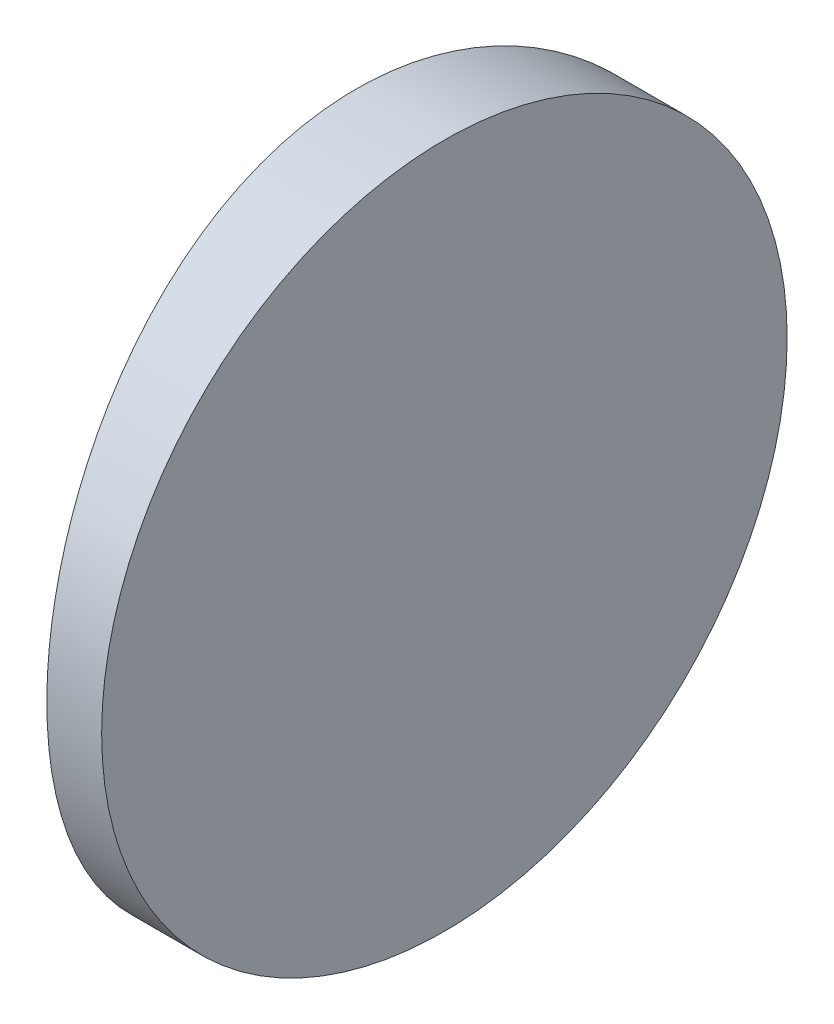
ISO-10303-21;
HEADER;
FILE_DESCRIPTION(('STEP AP214'),'2;1');
FILE_NAME('part.step','',(''),(''),'','','');
FILE_SCHEMA(('AUTOMOTIVE_DESIGN { 1 0 10303 214 1 1 1 1 }'));
ENDSEC;
DATA;
#1=APPLICATION_CONTEXT('core data for automotive mechanical design processes');
#2=APPLICATION_PROTOCOL_DEFINITION('international standard','automotive_design',2000,#1);
#3=PRODUCT_CONTEXT('',#1,'mechanical');
#4=PRODUCT('Part','Part','',(#3));
#5=PRODUCT_RELATED_PRODUCT_CATEGORY('part','',(#4));
#6=PRODUCT_DEFINITION_FORMATION('','',#4);
#7=PRODUCT_DEFINITION_CONTEXT('part definition',#1,'design');
#8=PRODUCT_DEFINITION('design','',#6,#7);
#9=PRODUCT_DEFINITION_SHAPE('','',#8);
#10=(LENGTH_UNIT() NAMED_UNIT(*) SI_UNIT(.MILLI.,.METRE.));
#11=(NAMED_UNIT(*) PLANE_ANGLE_UNIT() SI_UNIT($,.RADIAN.));
#12=(NAMED_UNIT(*) SI_UNIT($,.STERADIAN.) SOLID_ANGLE_UNIT());
#13=UNCERTAINTY_MEASURE_WITH_UNIT(LENGTH_MEASURE(1.E-05),#10,'distance_accuracy_value','');
#14=(GEOMETRIC_REPRESENTATION_CONTEXT(3) GLOBAL_UNCERTAINTY_ASSIGNED_CONTEXT((#13)) GLOBAL_UNIT_ASSIGNED_CONTEXT((#10,
#11,#12)) REPRESENTATION_CONTEXT('',''));
#15=CARTESIAN_POINT('',(0.,0.,0.));
#16=DIRECTION('',(0.,0.,1.));
#17=DIRECTION('',(1.,0.,0.));
#18=AXIS2_PLACEMENT_3D('',#15,#16,#17);
#19=CARTESIAN_POINT('',(4.35520433485127,25.,0.));
#20=DIRECTION('',(0.,-1.,0.));
#21=DIRECTION('',(0.,0.,-1.));
#22=AXIS2_PLACEMENT_3D('',#19,#20,#21);
#23=CYLINDRICAL_SURFACE('',#22,64.6);
#24=CARTESIAN_POINT('',(-60.2447956651487,0.,0.));
#25=CARTESIAN_POINT('',(-60.2447978642015,-4.47395701819799E-06,-0.34765061204116));
#26=CARTESIAN_POINT('',(-60.2419838845254,0.0145088133136891,-0.695238878843603));
#27=CARTESIAN_POINT('',(-60.2308108472901,0.0724415721339745,-1.3880179192886));
#28=CARTESIAN_POINT('',(-60.2224505623605,0.11586744190507,-1.73320814516723));
#29=CARTESIAN_POINT('',(-60.2004052203235,0.231343913212658,-2.4189012180177));
#30=CARTESIAN_POINT('',(-60.1867154092606,0.303420072116305,-2.75939959829363));
#31=CARTESIAN_POINT('',(-60.1543937983129,0.475633075482622,-3.43299360409676));
#32=CARTESIAN_POINT('',(-60.13576186904,0.575770654617422,-3.76608903556191));
#33=CARTESIAN_POINT('',(-60.094094745227,0.803221502005653,-4.42219458082528));
#34=CARTESIAN_POINT('',(-60.0710641031345,0.930506689599237,-4.74521472344349));
#35=CARTESIAN_POINT('',(-60.0212209925623,1.21136737622966,-5.37931384719283));
#36=CARTESIAN_POINT('',(-59.9944084768082,1.36494320391121,-5.69039267899273));
#37=CARTESIAN_POINT('',(-59.937740218217,1.69724548066512,-6.29845358291933));
#38=CARTESIAN_POINT('',(-59.9078849713435,1.87596783266805,-6.5954379409084));
#39=CARTESIAN_POINT('',(-59.845940933979,2.25732267732487,-7.17338318000197));
#40=CARTESIAN_POINT('',(-59.8138521570897,2.45995502437788,-7.45434415866605));
#41=CARTESIAN_POINT('',(-59.7479406019272,2.89016800994314,-8.00147515213488));
#42=CARTESIAN_POINT('',(-59.7141022968138,3.1180052969769,-8.26744152275114));
#43=CARTESIAN_POINT('',(-59.6459719461591,3.59515261684848,-8.7793002924865));
#44=CARTESIAN_POINT('',(-59.6116798955007,3.84446289202493,-9.02519246499234));
#45=CARTESIAN_POINT('',(-59.5435880606616,4.36294174682594,-9.49530269703114));
#46=CARTESIAN_POINT('',(-59.5097884236597,4.63211612355901,-9.71951438490803));
#47=CARTESIAN_POINT('',(-59.4436408586705,5.18843986021949,-10.1446362226158));
#48=CARTESIAN_POINT('',(-59.4112929147794,5.47558902314327,-10.34554662776));
#49=CARTESIAN_POINT('',(-59.348686304986,6.06856484464821,-10.7243421840682));
#50=CARTESIAN_POINT('',(-59.3184488712709,6.37453537096646,-10.902005744523));
#51=CARTESIAN_POINT('',(-59.2612668113804,7.00067398099642,-11.2308712123767));
#52=CARTESIAN_POINT('',(-59.2343221638536,7.32084197262934,-11.3820732913624));
#53=CARTESIAN_POINT('',(-59.1845468915196,7.97280675108691,-11.6567362496679));
#54=CARTESIAN_POINT('',(-59.1617121786897,8.3045915860934,-11.7802247253702));
#55=CARTESIAN_POINT('',(-59.1208107103263,8.97759357839283,-11.9986594820489));
#56=CARTESIAN_POINT('',(-59.1027427871912,9.31880840319166,-12.0936127533776));
#57=CARTESIAN_POINT('',(-59.0665838199291,10.1277030843062,-12.2820655606775));
#58=CARTESIAN_POINT('',(-59.0506471724395,10.5982964410256,-12.3636980310325));
#59=CARTESIAN_POINT('',(-59.0293035642208,11.545965756378,-12.4726616378771));
#60=CARTESIAN_POINT('',(-59.0238963963328,12.0230415872876,-12.4999938426803));
#61=CARTESIAN_POINT('',(-59.0238908115981,12.8475821454311,-12.50000448713));
#62=CARTESIAN_POINT('',(-59.0267583404281,13.1951019332754,-12.4854968592692));
#63=CARTESIAN_POINT('',(-59.038139100787,13.8877421479409,-12.4275872636856));
#64=CARTESIAN_POINT('',(-59.0466535836075,14.2328620258423,-12.3841788919247));
#65=CARTESIAN_POINT('',(-59.0690907355566,14.9184127329047,-12.2687503054409));
#66=CARTESIAN_POINT('',(-59.0830182514507,15.2588390758679,-12.1967044477355));
#67=CARTESIAN_POINT('',(-59.1158715902605,15.932287528186,-12.0245661913625));
#68=CARTESIAN_POINT('',(-59.1347975475306,16.2653094382542,-11.9244730388));
#69=CARTESIAN_POINT('',(-59.177074881072,16.9212585544489,-11.6971294603511));
#70=CARTESIAN_POINT('',(-59.2004215337982,17.2441961106089,-11.5699080031163));
#71=CARTESIAN_POINT('',(-59.2508842691491,17.8781370009291,-11.2891902376088));
#72=CARTESIAN_POINT('',(-59.2780003989176,18.1891401857674,-11.1356936007139));
#73=CARTESIAN_POINT('',(-59.3352300089981,18.797063043676,-10.8035619050044));
#74=CARTESIAN_POINT('',(-59.3653430101333,19.0939849570601,-10.6249308631053));
#75=CARTESIAN_POINT('',(-59.4277284468723,19.6718221171752,-10.2437671220329));
#76=CARTESIAN_POINT('',(-59.4600008694201,19.9527374606638,-10.0412345673638));
#77=CARTESIAN_POINT('',(-59.5262030985126,20.4999286409715,-9.61112221280609));
#78=CARTESIAN_POINT('',(-59.5601479818695,20.7659923010883,-9.38327475516471));
#79=CARTESIAN_POINT('',(-59.6283849640762,21.2780467273352,-8.90608645832857));
#80=CARTESIAN_POINT('',(-59.6626770669208,21.5240372622211,-8.65674537159317));
#81=CARTESIAN_POINT('',(-59.7306624736156,21.9943402450243,-8.13818524774276));
#82=CARTESIAN_POINT('',(-59.7643556030119,22.2186464590435,-7.86896053340702));
#83=CARTESIAN_POINT('',(-59.8301956873185,22.6439503083584,-7.31251665610232));
#84=CARTESIAN_POINT('',(-59.8623426598291,22.8449482090152,-7.02529769805215));
#85=CARTESIAN_POINT('',(-59.9244627043524,23.2238442885441,-6.43226492152603));
#86=CARTESIAN_POINT('',(-59.9544147231713,23.4015291382141,-6.12631252984193));
#87=CARTESIAN_POINT('',(-60.010986365014,23.7304390716185,-5.50020815172549));
#88=CARTESIAN_POINT('',(-60.0376060091446,23.881664322947,-5.18005625524835));
#89=CARTESIAN_POINT('',(-60.0867292450623,24.156374697604,-4.5281237107606));
#90=CARTESIAN_POINT('',(-60.1092369072273,24.2798872811511,-4.19635495411948));
#91=CARTESIAN_POINT('',(-60.1495195438611,24.4983706863174,-3.52338908422798));
#92=CARTESIAN_POINT('',(-60.1672956733363,24.5933484742469,-3.18219429443887));
#93=CARTESIAN_POINT('',(-60.2028606264699,24.7819076225632,-2.37315153595249));
#94=CARTESIAN_POINT('',(-60.2185192011776,24.8635996596902,-1.90238647192214));
#95=CARTESIAN_POINT('',(-60.2394851163035,24.9726422786126,-0.954375048166079));
#96=CARTESIAN_POINT('',(-60.2447926470857,24.9999938597727,-0.477128807796941));
#97=CARTESIAN_POINT('',(-60.2447978642015,25.000004473957,0.347650612041196));
#98=CARTESIAN_POINT('',(-60.2419838845254,24.9854911866863,0.69523887884364));
#99=CARTESIAN_POINT('',(-60.2308108472901,24.927558427866,1.38801791928864));
#100=CARTESIAN_POINT('',(-60.2224505623605,24.8841325580949,1.73320814516727));
#101=CARTESIAN_POINT('',(-60.2004052203235,24.7686560867873,2.41890121801774));
#102=CARTESIAN_POINT('',(-60.1867154092606,24.6965799278837,2.75939959829367));
#103=CARTESIAN_POINT('',(-60.1543937983129,24.5243669245174,3.43299360409679));
#104=CARTESIAN_POINT('',(-60.13576186904,24.4242293453826,3.76608903556194));
#105=CARTESIAN_POINT('',(-60.094094745227,24.1967784979943,4.42219458082531));
#106=CARTESIAN_POINT('',(-60.0710641031345,24.0694933104008,4.74521472344353));
#107=CARTESIAN_POINT('',(-60.0212209925623,23.7886326237703,5.37931384719287));
#108=CARTESIAN_POINT('',(-59.9944084768082,23.6350567960888,5.69039267899277));
#109=CARTESIAN_POINT('',(-59.9377402182169,23.3027545193349,6.29845358291936));
#110=CARTESIAN_POINT('',(-59.9078849713435,23.124032167332,6.59543794090843));
#111=CARTESIAN_POINT('',(-59.845940933979,22.7426773226751,7.17338318000201));
#112=CARTESIAN_POINT('',(-59.8138521570897,22.5400449756221,7.45434415866608));
#113=CARTESIAN_POINT('',(-59.7479406019272,22.1098319900569,8.00147515213492));
#114=CARTESIAN_POINT('',(-59.7141022968138,21.8819947030231,8.26744152275118));
#115=CARTESIAN_POINT('',(-59.6459719461591,21.4048473831515,8.77930029248654));
#116=CARTESIAN_POINT('',(-59.6116798955007,21.1555371079751,9.02519246499237));
#117=CARTESIAN_POINT('',(-59.5435880606616,20.6370582531741,9.49530269703118));
#118=CARTESIAN_POINT('',(-59.5097884236597,20.367883876441,9.71951438490807));
#119=CARTESIAN_POINT('',(-59.4436408586705,19.8115601397805,10.1446362226159));
#120=CARTESIAN_POINT('',(-59.4112929147794,19.5244109768567,10.34554662776));
#121=CARTESIAN_POINT('',(-59.348686304986,18.9314351553518,10.7243421840683));
#122=CARTESIAN_POINT('',(-59.3184488712709,18.6254646290335,10.902005744523));
#123=CARTESIAN_POINT('',(-59.2612668113804,17.9993260190036,11.2308712123768));
#124=CARTESIAN_POINT('',(-59.2343221638536,17.6791580273707,11.3820732913624));
#125=CARTESIAN_POINT('',(-59.1845468915196,17.0271932489131,11.6567362496679));
#126=CARTESIAN_POINT('',(-59.1617121786897,16.6954084139066,11.7802247253702));
#127=CARTESIAN_POINT('',(-59.1208107103263,16.0224064216072,11.998659482049));
#128=CARTESIAN_POINT('',(-59.1027427871912,15.6811915968083,12.0936127533776));
#129=CARTESIAN_POINT('',(-59.0665838199291,14.8722969156938,12.2820655606775));
#130=CARTESIAN_POINT('',(-59.0506471724395,14.4017035589744,12.3636980310325));
#131=CARTESIAN_POINT('',(-59.0293035642208,13.454034243622,12.4726616378771));
#132=CARTESIAN_POINT('',(-59.0238963963328,12.9769584127124,12.4999938426803));
#133=CARTESIAN_POINT('',(-59.0238908115981,12.1524178545689,12.50000448713));
#134=CARTESIAN_POINT('',(-59.0267583404281,11.8048980667246,12.4854968592692));
#135=CARTESIAN_POINT('',(-59.038139100787,11.1122578520591,12.4275872636857));
#136=CARTESIAN_POINT('',(-59.0466535836075,10.7671379741577,12.3841788919248));
#137=CARTESIAN_POINT('',(-59.0690907355566,10.0815872670953,12.2687503054409));
#138=CARTESIAN_POINT('',(-59.0830182514507,9.74116092413208,12.1967044477355));
#139=CARTESIAN_POINT('',(-59.1158715902605,9.06771247181405,12.0245661913625));
#140=CARTESIAN_POINT('',(-59.1347975475306,8.73469056174579,11.9244730388));
#141=CARTESIAN_POINT('',(-59.177074881072,8.0787414455511,11.6971294603511));
#142=CARTESIAN_POINT('',(-59.2004215337982,7.75580388939112,11.5699080031163));
#143=CARTESIAN_POINT('',(-59.2508842691491,7.12186299907088,11.2891902376088));
#144=CARTESIAN_POINT('',(-59.2780003989175,6.81085981423263,11.1356936007139));
#145=CARTESIAN_POINT('',(-59.3352300089981,6.20293695632404,10.8035619050044));
#146=CARTESIAN_POINT('',(-59.3653430101333,5.90601504293991,10.6249308631054));
#147=CARTESIAN_POINT('',(-59.4277284468723,5.32817788282483,10.2437671220329));
#148=CARTESIAN_POINT('',(-59.4600008694201,5.0472625393362,10.0412345673638));
#149=CARTESIAN_POINT('',(-59.5262030985126,4.5000713590285,9.61112221280612));
#150=CARTESIAN_POINT('',(-59.5601479818695,4.23400769891169,9.38327475516475));
#151=CARTESIAN_POINT('',(-59.6283849640762,3.72195327266476,8.9060864583286));
#152=CARTESIAN_POINT('',(-59.6626770669208,3.47596273777895,8.65674537159321));
#153=CARTESIAN_POINT('',(-59.7306624736156,3.00565975497575,8.13818524774279));
#154=CARTESIAN_POINT('',(-59.7643556030119,2.78135354095646,7.86896053340705));
#155=CARTESIAN_POINT('',(-59.8301956873185,2.35604969164159,7.31251665610235));
#156=CARTESIAN_POINT('',(-59.8623426598291,2.15505179098477,7.02529769805218));
#157=CARTESIAN_POINT('',(-59.9244627043524,1.77615571145587,6.43226492152606));
#158=CARTESIAN_POINT('',(-59.9544147231713,1.59847086178591,6.12631252984196));
#159=CARTESIAN_POINT('',(-60.010986365014,1.2695609283815,5.50020815172552));
#160=CARTESIAN_POINT('',(-60.0376060091445,1.11833567705298,5.18005625524838));
#161=CARTESIAN_POINT('',(-60.0867292450623,0.843625302396044,4.52812371076063));
#162=CARTESIAN_POINT('',(-60.1092369072273,0.720112718848901,4.19635495411952));
#163=CARTESIAN_POINT('',(-60.1495195438611,0.501629313682597,3.52338908422802));
#164=CARTESIAN_POINT('',(-60.1672956733363,0.406651525753078,3.1821942944389));
#165=CARTESIAN_POINT('',(-60.2028606264698,0.218092377436772,2.37315153595252));
#166=CARTESIAN_POINT('',(-60.2185192011776,0.136400340309756,1.90238647192218));
#167=CARTESIAN_POINT('',(-60.2394851163035,0.0273577213873744,0.954375048166116));
#168=CARTESIAN_POINT('',(-60.2447926470857,6.14022728567065E-06,0.477128807796977));
#169=CARTESIAN_POINT('',(-60.2447956651487,0.,0.));
#170=B_SPLINE_CURVE_WITH_KNOTS('',3,(#24,#25,#26,#27,#28,#29,#30,#31,#32,#33,#34,#35,#36,#37,
#38,#39,#40,#41,#42,#43,#44,#45,#46,#47,#48,#49,#50,#51,#52,#53,#54,#55,#56,#57,#58,#59,#60,#61,
#62,#63,#64,#65,#66,#67,#68,#69,#70,#71,#72,#73,#74,#75,#76,#77,#78,#79,#80,#81,#82,#83,#84,#85,
#86,#87,#88,#89,#90,#91,#92,#93,#94,#95,#96,#97,#98,#99,#100,#101,#102,#103,#104,#105,#106,#107,
#108,#109,#110,#111,#112,#113,#114,#115,#116,#117,#118,#119,#120,#121,#122,#123,#124,#125,#126,
#127,#128,#129,#130,#131,#132,#133,#134,#135,#136,#137,#138,#139,#140,#141,#142,#143,#144,#145,
#146,#147,#148,#149,#150,#151,#152,#153,#154,#155,#156,#157,#158,#159,#160,#161,#162,#163,#164,
#165,#166,#167,#168,#169),.UNSPECIFIED.,.T.,.F.,(4,2,2,2,2,2,2,2,2,2,2,2,2,2,2,2,2,2,2,2,2,2,2,
2,2,2,2,2,2,2,2,2,2,2,2,2,2,2,2,2,2,2,2,2,2,2,2,2,2,2,2,2,2,2,2,2,2,2,2,2,2,2,2,2,2,2,2,2,2,2,2,
2,4),(0.,1.04253066851136,2.08529212098065,3.12898585933525,4.1727069250434,5.21535358835579,
6.25801328616805,7.30050330195736,8.34298696978899,9.3972817763581,10.4515884829872,
11.5062041029979,12.5608081664455,13.6248280059222,14.6888409456222,15.7517896247922,
16.8144776976634,18.2448027913932,19.6750997443581,20.7174247569055,21.7599808123533,
22.8034725187132,23.8469922762095,24.8894032538177,25.9318272697489,26.9740848769964,
28.0163361832609,29.0709015305555,30.1254790248287,31.1803587973981,32.2352265591595,
33.2991584690187,34.3630836397307,35.4259498750033,36.4885564173692,37.9193911288951,
39.3501995259753,40.3927301944866,41.4354916469559,42.4791853853105,43.5229064510187,
44.565553114331,45.6082128121433,46.6507028279326,47.6931864957642,48.7474813023334,
49.8017880089624,50.8564036289731,51.9110076924207,52.9750275318974,54.0390404715974,
55.1019891507675,56.1646772236387,57.5950023173685,59.0252992703333,60.0676242828808,
61.1101803383286,62.1536720446885,63.1971918021847,64.239602779793,65.2820267957242,
66.3242844029716,67.3665357092361,68.4211010565308,69.475678550804,70.5305583233734,
71.5854260851348,72.649357994994,73.713283165706,74.7761494009786,75.8387559433445,
77.2695906548703,78.7003990519505),.UNSPECIFIED.);
#171=CARTESIAN_POINT('',(-60.2447956651487,0.,0.));
#172=VERTEX_POINT('',#171);
#173=EDGE_CURVE('E10',#172,#172,#170,.T.);
#174=ORIENTED_EDGE('',*,*,#173,.F.);
#175=EDGE_LOOP('',(#174));
#176=FACE_BOUND('',#175,.T.);
#177=ADVANCED_FACE('F35',(#176),#23,.T.);
#178=CARTESIAN_POINT('',(-57.0247956651487,25.,-12.5));
#179=DIRECTION('',(1.,0.,0.));
#180=DIRECTION('',(0.,0.,-1.));
#181=AXIS2_PLACEMENT_3D('',#178,#179,#180);
#182=PLANE('',#181);
#183=CARTESIAN_POINT('',(-57.0247956651487,12.5,0.));
#184=DIRECTION('',(1.,0.,0.));
#185=DIRECTION('',(0.,0.,-1.));
#186=AXIS2_PLACEMENT_3D('',#183,#184,#185);
#187=CIRCLE('',#186,12.5);
#188=CARTESIAN_POINT('',(-57.0247956651487,12.5,-12.5));
#189=VERTEX_POINT('',#188);
#190=EDGE_CURVE('E45',#189,#189,#187,.T.);
#191=ORIENTED_EDGE('',*,*,#190,.T.);
#192=EDGE_LOOP('',(#191));
#193=FACE_BOUND('',#192,.T.);
#194=ADVANCED_FACE('F37',(#193),#182,.T.);
#195=CARTESIAN_POINT('',(-69.7247956651487,12.5,0.));
#196=DIRECTION('',(1.,0.,0.));
#197=DIRECTION('',(0.,0.,-1.));
#198=AXIS2_PLACEMENT_3D('',#195,#196,#197);
#199=CYLINDRICAL_SURFACE('',#198,12.5);
#200=ORIENTED_EDGE('',*,*,#190,.F.);
#201=EDGE_LOOP('',(#200));
#202=FACE_BOUND('',#201,.T.);
#203=ORIENTED_EDGE('',*,*,#173,.T.);
#204=EDGE_LOOP('',(#203));
#205=FACE_BOUND('',#204,.T.);
#206=ADVANCED_FACE('F52',(#202,#205),#199,.T.);
#207=CLOSED_SHELL('',(#177,#194,#206));
#208=MANIFOLD_SOLID_BREP('B2',#207);
#209=ADVANCED_BREP_SHAPE_REPRESENTATION('',(#18,#208),#14);
#210=SHAPE_DEFINITION_REPRESENTATION(#9,#209);
ENDSEC;
END-ISO-10303-21;
